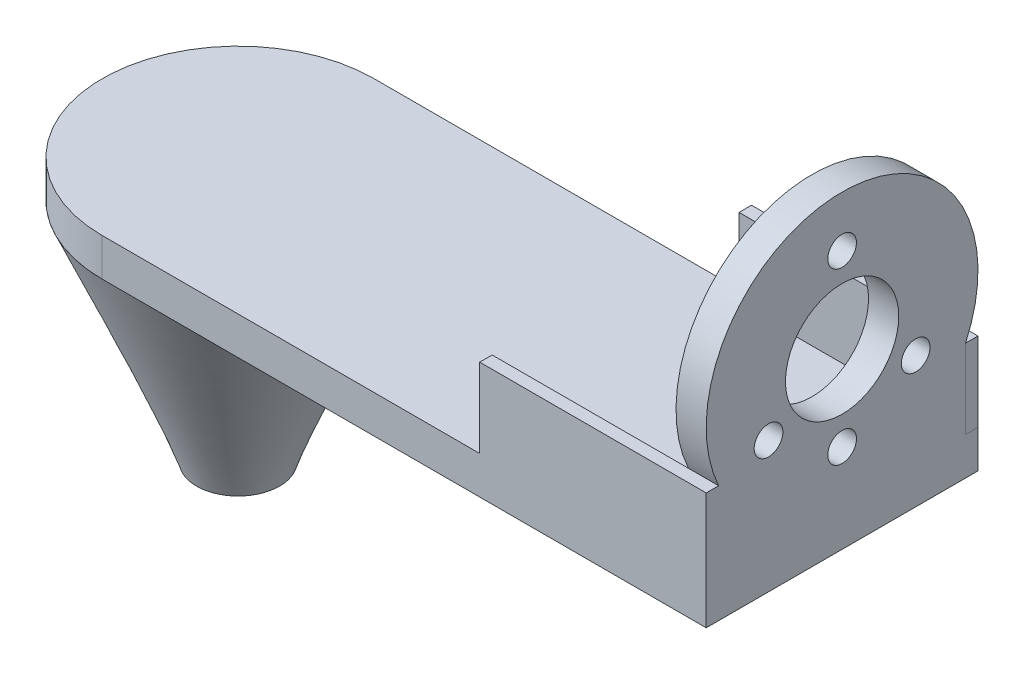
ISO-10303-21;
HEADER;
FILE_DESCRIPTION(('STEP AP214'),'2;1');
FILE_NAME('part.step','',(''),(''),'','','');
FILE_SCHEMA(('AUTOMOTIVE_DESIGN { 1 0 10303 214 1 1 1 1 }'));
ENDSEC;
DATA;
#1=APPLICATION_CONTEXT('core data for automotive mechanical design processes');
#2=APPLICATION_PROTOCOL_DEFINITION('international standard','automotive_design',2000,#1);
#3=PRODUCT_CONTEXT('',#1,'mechanical');
#4=PRODUCT('Part','Part','',(#3));
#5=PRODUCT_RELATED_PRODUCT_CATEGORY('part','',(#4));
#6=PRODUCT_DEFINITION_FORMATION('','',#4);
#7=PRODUCT_DEFINITION_CONTEXT('part definition',#1,'design');
#8=PRODUCT_DEFINITION('design','',#6,#7);
#9=PRODUCT_DEFINITION_SHAPE('','',#8);
#10=(LENGTH_UNIT() NAMED_UNIT(*) SI_UNIT(.MILLI.,.METRE.));
#11=(NAMED_UNIT(*) PLANE_ANGLE_UNIT() SI_UNIT($,.RADIAN.));
#12=(NAMED_UNIT(*) SI_UNIT($,.STERADIAN.) SOLID_ANGLE_UNIT());
#13=UNCERTAINTY_MEASURE_WITH_UNIT(LENGTH_MEASURE(1.E-05),#10,'distance_accuracy_value','');
#14=(GEOMETRIC_REPRESENTATION_CONTEXT(3) GLOBAL_UNCERTAINTY_ASSIGNED_CONTEXT((#13)) GLOBAL_UNIT_ASSIGNED_CONTEXT((#10,
#11,#12)) REPRESENTATION_CONTEXT('',''));
#15=CARTESIAN_POINT('',(0.,0.,0.));
#16=DIRECTION('',(0.,0.,1.));
#17=DIRECTION('',(1.,0.,0.));
#18=AXIS2_PLACEMENT_3D('',#15,#16,#17);
#19=CARTESIAN_POINT('',(35.7169744385048,48.2713976551319,84.2435072904092));
#20=DIRECTION('',(0.,-1.,0.));
#21=DIRECTION('',(0.,0.,-1.));
#22=AXIS2_PLACEMENT_3D('',#19,#20,#21);
#23=PLANE('',#22);
#24=DIRECTION('',(0.,0.,-1.));
#25=VECTOR('',#24,1.);
#26=CARTESIAN_POINT('',(65.7169744385048,48.2713976551319,84.2435072904092));
#27=LINE('',#26,#25);
#28=CARTESIAN_POINT('',(65.7169744385048,48.2713976551319,67.8905021606148));
#29=VERTEX_POINT('',#28);
#30=CARTESIAN_POINT('',(65.7169744385048,48.2713976551319,66.2435072904092));
#31=VERTEX_POINT('',#30);
#32=EDGE_CURVE('P0_E79',#29,#31,#27,.T.);
#33=ORIENTED_EDGE('',*,*,#32,.T.);
#34=DIRECTION('',(1.,0.,0.));
#35=VECTOR('',#34,1.);
#36=CARTESIAN_POINT('',(35.7169744385048,48.2713976551319,66.2435072904092));
#37=LINE('',#36,#35);
#38=CARTESIAN_POINT('',(35.7169744385048,48.2713976551319,66.2435072904092));
#39=VERTEX_POINT('',#38);
#40=EDGE_CURVE('P0_E11',#39,#31,#37,.T.);
#41=ORIENTED_EDGE('',*,*,#40,.F.);
#42=DIRECTION('',(0.,0.,-1.));
#43=VECTOR('',#42,1.);
#44=CARTESIAN_POINT('',(35.7169744385048,48.2713976551319,84.2435072904092));
#45=LINE('',#44,#43);
#46=CARTESIAN_POINT('',(35.7169744385048,48.2713976551319,67.8905021606148));
#47=VERTEX_POINT('',#46);
#48=EDGE_CURVE('P0_E34',#47,#39,#45,.T.);
#49=ORIENTED_EDGE('',*,*,#48,.F.);
#50=DIRECTION('',(1.,0.,0.));
#51=VECTOR('',#50,1.);
#52=CARTESIAN_POINT('',(35.7169744385048,48.2713976551319,67.8905021606148));
#53=LINE('',#52,#51);
#54=EDGE_CURVE('P0_E19',#47,#29,#53,.T.);
#55=ORIENTED_EDGE('',*,*,#54,.T.);
#56=EDGE_LOOP('',(#33,#41,#49,#55));
#57=FACE_BOUND('',#56,.T.);
#58=ADVANCED_FACE('P0_F16',(#57),#23,.F.);
#59=CARTESIAN_POINT('',(35.7169744385048,38.2933138488233,66.2435072904092));
#60=DIRECTION('',(0.,0.,-1.));
#61=DIRECTION('',(-1.,0.,0.));
#62=AXIS2_PLACEMENT_3D('',#59,#60,#61);
#63=PLANE('',#62);
#64=DIRECTION('',(0.,1.,0.));
#65=VECTOR('',#64,1.);
#66=CARTESIAN_POINT('',(65.7169744385048,38.2933138488233,66.2435072904092));
#67=LINE('',#66,#65);
#68=CARTESIAN_POINT('',(65.7169744385048,37.7933138488233,66.2435072904092));
#69=VERTEX_POINT('',#68);
#70=EDGE_CURVE('P0_E75',#69,#31,#67,.T.);
#71=ORIENTED_EDGE('',*,*,#70,.F.);
#72=DIRECTION('',(1.,0.,0.));
#73=VECTOR('',#72,1.);
#74=CARTESIAN_POINT('',(35.7169744385048,37.7933138488233,66.2435072904092));
#75=LINE('',#74,#73);
#76=CARTESIAN_POINT('',(35.7169744385048,37.7933138488233,66.2435072904092));
#77=VERTEX_POINT('',#76);
#78=EDGE_CURVE('P0_E25',#77,#69,#75,.T.);
#79=ORIENTED_EDGE('',*,*,#78,.F.);
#80=DIRECTION('',(0.,1.,0.));
#81=VECTOR('',#80,1.);
#82=CARTESIAN_POINT('',(35.7169744385048,38.2933138488233,66.2435072904092));
#83=LINE('',#82,#81);
#84=EDGE_CURVE('P0_E71',#77,#39,#83,.T.);
#85=ORIENTED_EDGE('',*,*,#84,.T.);
#86=ORIENTED_EDGE('',*,*,#40,.T.);
#87=EDGE_LOOP('',(#71,#79,#85,#86));
#88=FACE_BOUND('',#87,.T.);
#89=ADVANCED_FACE('P0_F89',(#88),#63,.T.);
#90=CARTESIAN_POINT('',(35.7169744385048,37.7933138488233,84.2435072904092));
#91=DIRECTION('',(0.,-1.,0.));
#92=DIRECTION('',(0.,0.,-1.));
#93=AXIS2_PLACEMENT_3D('',#90,#91,#92);
#94=PLANE('',#93);
#95=DIRECTION('',(0.,0.,-1.));
#96=VECTOR('',#95,1.);
#97=CARTESIAN_POINT('',(65.7169744385048,37.7933138488233,84.2435072904092));
#98=LINE('',#97,#96);
#99=CARTESIAN_POINT('',(65.7169744385048,37.7933138488233,67.8905021606148));
#100=VERTEX_POINT('',#99);
#101=EDGE_CURVE('P0_E67',#100,#69,#98,.T.);
#102=ORIENTED_EDGE('',*,*,#101,.F.);
#103=DIRECTION('',(1.,0.,0.));
#104=VECTOR('',#103,1.);
#105=CARTESIAN_POINT('',(35.7169744385048,37.7933138488233,67.8905021606148));
#106=LINE('',#105,#104);
#107=CARTESIAN_POINT('',(35.7169744385048,37.7933138488233,67.8905021606148));
#108=VERTEX_POINT('',#107);
#109=EDGE_CURVE('P0_E63',#108,#100,#106,.T.);
#110=ORIENTED_EDGE('',*,*,#109,.F.);
#111=DIRECTION('',(0.,0.,-1.));
#112=VECTOR('',#111,1.);
#113=CARTESIAN_POINT('',(35.7169744385048,37.7933138488233,84.2435072904092));
#114=LINE('',#113,#112);
#115=EDGE_CURVE('P0_E66',#108,#77,#114,.T.);
#116=ORIENTED_EDGE('',*,*,#115,.T.);
#117=ORIENTED_EDGE('',*,*,#78,.T.);
#118=EDGE_LOOP('',(#102,#110,#116,#117));
#119=FACE_BOUND('',#118,.T.);
#120=ADVANCED_FACE('P0_F65',(#119),#94,.T.);
#121=CARTESIAN_POINT('',(35.7169744385048,38.2933138488233,67.8905021606148));
#122=DIRECTION('',(0.,0.,1.));
#123=DIRECTION('',(1.,0.,0.));
#124=AXIS2_PLACEMENT_3D('',#121,#122,#123);
#125=PLANE('',#124);
#126=DIRECTION('',(0.,-1.,0.));
#127=VECTOR('',#126,1.);
#128=CARTESIAN_POINT('',(65.7169744385048,38.2933138488233,67.8905021606148));
#129=LINE('',#128,#127);
#130=EDGE_CURVE('P0_E81',#29,#100,#129,.T.);
#131=ORIENTED_EDGE('',*,*,#130,.F.);
#132=ORIENTED_EDGE('',*,*,#54,.F.);
#133=DIRECTION('',(0.,-1.,0.));
#134=VECTOR('',#133,1.);
#135=CARTESIAN_POINT('',(35.7169744385048,38.2933138488233,67.8905021606148));
#136=LINE('',#135,#134);
#137=EDGE_CURVE('P0_E70',#47,#108,#136,.T.);
#138=ORIENTED_EDGE('',*,*,#137,.T.);
#139=ORIENTED_EDGE('',*,*,#109,.T.);
#140=EDGE_LOOP('',(#131,#132,#138,#139));
#141=FACE_BOUND('',#140,.T.);
#142=ADVANCED_FACE('P0_F73',(#141),#125,.T.);
#143=CARTESIAN_POINT('',(35.7169744385048,38.2933138488233,84.2435072904092));
#144=DIRECTION('',(1.,0.,0.));
#145=DIRECTION('',(0.,0.,-1.));
#146=AXIS2_PLACEMENT_3D('',#143,#144,#145);
#147=PLANE('',#146);
#148=ORIENTED_EDGE('',*,*,#48,.T.);
#149=ORIENTED_EDGE('',*,*,#84,.F.);
#150=ORIENTED_EDGE('',*,*,#115,.F.);
#151=ORIENTED_EDGE('',*,*,#137,.F.);
#152=EDGE_LOOP('',(#148,#149,#150,#151));
#153=FACE_BOUND('',#152,.T.);
#154=ADVANCED_FACE('P0_F69',(#153),#147,.F.);
#155=CARTESIAN_POINT('',(65.7169744385048,38.2933138488233,84.2435072904092));
#156=DIRECTION('',(1.,0.,0.));
#157=DIRECTION('',(0.,0.,-1.));
#158=AXIS2_PLACEMENT_3D('',#155,#156,#157);
#159=PLANE('',#158);
#160=ORIENTED_EDGE('',*,*,#32,.F.);
#161=ORIENTED_EDGE('',*,*,#130,.T.);
#162=ORIENTED_EDGE('',*,*,#101,.T.);
#163=ORIENTED_EDGE('',*,*,#70,.T.);
#164=EDGE_LOOP('',(#160,#161,#162,#163));
#165=FACE_BOUND('',#164,.T.);
#166=ADVANCED_FACE('P0_F88',(#165),#159,.T.);
#167=CLOSED_SHELL('',(#58,#89,#120,#142,#154,#166));
#168=MANIFOLD_SOLID_BREP('P0_B1',#167);
#169=CARTESIAN_POINT('',(-14.2830255614952,32.7933138488233,84.2435072904092));
#170=DIRECTION('',(0.,1.,0.));
#171=DIRECTION('',(0.,0.,1.));
#172=AXIS2_PLACEMENT_3D('',#169,#170,#171);
#173=CYLINDRICAL_SURFACE('',#172,18.);
#174=DIRECTION('',(0.,1.,0.));
#175=VECTOR('',#174,1.);
#176=CARTESIAN_POINT('',(-14.2830255614952,38.2933138488233,102.243507290409));
#177=LINE('',#176,#175);
#178=CARTESIAN_POINT('',(-14.2830255614952,32.7933138488233,102.243507290409));
#179=VERTEX_POINT('',#178);
#180=CARTESIAN_POINT('',(-14.2830255614952,37.7933138488233,102.243507290409));
#181=VERTEX_POINT('',#180);
#182=EDGE_CURVE('P1_E107',#179,#181,#177,.T.);
#183=ORIENTED_EDGE('',*,*,#182,.T.);
#184=CARTESIAN_POINT('',(-14.2830255614952,37.7933138488233,84.2435072904092));
#185=DIRECTION('',(0.,1.,0.));
#186=DIRECTION('',(0.,0.,1.));
#187=AXIS2_PLACEMENT_3D('',#184,#185,#186);
#188=CIRCLE('',#187,18.);
#189=CARTESIAN_POINT('',(-14.2830255614952,37.7933138488233,66.2435072904092));
#190=VERTEX_POINT('',#189);
#191=EDGE_CURVE('P1_E90',#190,#181,#188,.T.);
#192=ORIENTED_EDGE('',*,*,#191,.F.);
#193=DIRECTION('',(0.,-1.,0.));
#194=VECTOR('',#193,1.);
#195=CARTESIAN_POINT('',(-14.2830255614952,38.2933138488233,66.2435072904092));
#196=LINE('',#195,#194);
#197=CARTESIAN_POINT('',(-14.2830255614952,32.7933138488233,66.2435072904092));
#198=VERTEX_POINT('',#197);
#199=EDGE_CURVE('P1_E112',#190,#198,#196,.T.);
#200=ORIENTED_EDGE('',*,*,#199,.T.);
#201=CARTESIAN_POINT('',(-14.2830255614952,32.7933138488233,84.2435072904092));
#202=DIRECTION('',(0.,1.,0.));
#203=DIRECTION('',(0.,0.,1.));
#204=AXIS2_PLACEMENT_3D('',#201,#202,#203);
#205=CIRCLE('',#204,18.);
#206=EDGE_CURVE('P1_E101',#198,#179,#205,.T.);
#207=ORIENTED_EDGE('',*,*,#206,.T.);
#208=EDGE_LOOP('',(#183,#192,#200,#207));
#209=FACE_BOUND('',#208,.T.);
#210=ADVANCED_FACE('P1_F16',(#209),#173,.T.);
#211=CARTESIAN_POINT('',(-14.2830255614952,37.7933138488233,84.2435072904092));
#212=DIRECTION('',(0.,-1.,0.));
#213=DIRECTION('',(0.,0.,-1.));
#214=AXIS2_PLACEMENT_3D('',#211,#212,#213);
#215=PLANE('',#214);
#216=DIRECTION('',(1.,0.,0.));
#217=VECTOR('',#216,1.);
#218=CARTESIAN_POINT('',(61.7169744385048,37.7933138488233,67.8905021606148));
#219=LINE('',#218,#217);
#220=CARTESIAN_POINT('',(61.7169744385048,37.7933138488233,67.8905021606148));
#221=VERTEX_POINT('',#220);
#222=CARTESIAN_POINT('',(65.7169744385048,37.7933138488233,67.8905021606148));
#223=VERTEX_POINT('',#222);
#224=EDGE_CURVE('P1_E196',#221,#223,#219,.T.);
#225=ORIENTED_EDGE('',*,*,#224,.T.);
#226=DIRECTION('',(0.,0.,-1.));
#227=VECTOR('',#226,1.);
#228=CARTESIAN_POINT('',(65.7169744385048,37.7933138488233,84.2435072904092));
#229=LINE('',#228,#227);
#230=CARTESIAN_POINT('',(65.7169744385048,37.7933138488233,66.2435072904092));
#231=VERTEX_POINT('',#230);
#232=EDGE_CURVE('P1_E125',#223,#231,#229,.T.);
#233=ORIENTED_EDGE('',*,*,#232,.T.);
#234=DIRECTION('',(1.,0.,0.));
#235=VECTOR('',#234,1.);
#236=CARTESIAN_POINT('',(-14.2830255614952,37.7933138488233,66.2435072904092));
#237=LINE('',#236,#235);
#238=EDGE_CURVE('P1_E96',#190,#231,#237,.T.);
#239=ORIENTED_EDGE('',*,*,#238,.F.);
#240=ORIENTED_EDGE('',*,*,#191,.T.);
#241=DIRECTION('',(1.,0.,0.));
#242=VECTOR('',#241,1.);
#243=CARTESIAN_POINT('',(-14.2830255614952,37.7933138488233,102.243507290409));
#244=LINE('',#243,#242);
#245=CARTESIAN_POINT('',(35.7169744385048,37.7933138488233,102.243507290409));
#246=VERTEX_POINT('',#245);
#247=EDGE_CURVE('P1_E93',#181,#246,#244,.T.);
#248=ORIENTED_EDGE('',*,*,#247,.T.);
#249=DIRECTION('',(0.,0.,1.));
#250=VECTOR('',#249,1.);
#251=CARTESIAN_POINT('',(35.7169744385048,37.7933138488233,84.2435072904092));
#252=LINE('',#251,#250);
#253=CARTESIAN_POINT('',(35.7169744385048,37.7933138488233,100.596512420204));
#254=VERTEX_POINT('',#253);
#255=EDGE_CURVE('P1_E200',#254,#246,#252,.T.);
#256=ORIENTED_EDGE('',*,*,#255,.F.);
#257=DIRECTION('',(1.,0.,0.));
#258=VECTOR('',#257,1.);
#259=CARTESIAN_POINT('',(35.7169744385048,37.7933138488233,100.596512420204));
#260=LINE('',#259,#258);
#261=CARTESIAN_POINT('',(61.7169744385048,37.7933138488233,100.596512420204));
#262=VERTEX_POINT('',#261);
#263=EDGE_CURVE('P1_E128',#254,#262,#260,.T.);
#264=ORIENTED_EDGE('',*,*,#263,.T.);
#265=DIRECTION('',(0.,0.,1.));
#266=VECTOR('',#265,1.);
#267=CARTESIAN_POINT('',(61.7169744385048,37.7933138488233,84.2435072904092));
#268=LINE('',#267,#266);
#269=EDGE_CURVE('P1_E33',#221,#262,#268,.T.);
#270=ORIENTED_EDGE('',*,*,#269,.F.);
#271=EDGE_LOOP('',(#225,#233,#239,#240,#248,#256,#264,#270));
#272=FACE_BOUND('',#271,.T.);
#273=ADVANCED_FACE('P1_F92',(#272),#215,.F.);
#274=CARTESIAN_POINT('',(61.7169744385048,55.7933138488233,84.2435072904092));
#275=DIRECTION('',(1.,0.,0.));
#276=DIRECTION('',(0.,0.,-1.));
#277=AXIS2_PLACEMENT_3D('',#274,#275,#276);
#278=CYLINDRICAL_SURFACE('',#277,18.);
#279=CARTESIAN_POINT('',(65.7169744385048,55.7933138488233,84.2435072904092));
#280=DIRECTION('',(1.,0.,0.));
#281=DIRECTION('',(0.,0.,-1.));
#282=AXIS2_PLACEMENT_3D('',#279,#280,#281);
#283=CIRCLE('',#282,18.);
#284=CARTESIAN_POINT('',(65.7169744385048,48.2713976551319,67.8905021606148));
#285=VERTEX_POINT('',#284);
#286=CARTESIAN_POINT('',(65.7169744385048,48.2713976551319,100.596512420204));
#287=VERTEX_POINT('',#286);
#288=EDGE_CURVE('P1_E20',#285,#287,#283,.T.);
#289=ORIENTED_EDGE('',*,*,#288,.F.);
#290=DIRECTION('',(1.,0.,0.));
#291=VECTOR('',#290,1.);
#292=CARTESIAN_POINT('',(61.7169744385048,48.2713976551319,67.8905021606148));
#293=LINE('',#292,#291);
#294=CARTESIAN_POINT('',(61.7169744385048,48.2713976551319,67.8905021606148));
#295=VERTEX_POINT('',#294);
#296=EDGE_CURVE('P1_E40',#295,#285,#293,.T.);
#297=ORIENTED_EDGE('',*,*,#296,.F.);
#298=CARTESIAN_POINT('',(61.7169744385048,55.7933138488233,84.2435072904092));
#299=DIRECTION('',(1.,0.,0.));
#300=DIRECTION('',(0.,0.,-1.));
#301=AXIS2_PLACEMENT_3D('',#298,#299,#300);
#302=CIRCLE('',#301,18.);
#303=CARTESIAN_POINT('',(61.7169744385048,48.2713976551319,100.596512420204));
#304=VERTEX_POINT('',#303);
#305=EDGE_CURVE('P1_E11',#295,#304,#302,.T.);
#306=ORIENTED_EDGE('',*,*,#305,.T.);
#307=DIRECTION('',(1.,0.,0.));
#308=VECTOR('',#307,1.);
#309=CARTESIAN_POINT('',(61.7169744385048,48.2713976551319,100.596512420204));
#310=LINE('',#309,#308);
#311=EDGE_CURVE('P1_E140',#304,#287,#310,.T.);
#312=ORIENTED_EDGE('',*,*,#311,.T.);
#313=EDGE_LOOP('',(#289,#297,#306,#312));
#314=FACE_BOUND('',#313,.T.);
#315=ADVANCED_FACE('P1_F183',(#314),#278,.T.);
#316=CARTESIAN_POINT('',(61.7169744385048,55.7933138488233,84.2435072904092));
#317=DIRECTION('',(1.,0.,0.));
#318=DIRECTION('',(0.,0.,-1.));
#319=AXIS2_PLACEMENT_3D('',#316,#317,#318);
#320=CYLINDRICAL_SURFACE('',#319,7.5);
#321=CARTESIAN_POINT('',(61.7169744385048,55.7933138488233,84.2435072904092));
#322=DIRECTION('',(1.,0.,0.));
#323=DIRECTION('',(0.,0.,-1.));
#324=AXIS2_PLACEMENT_3D('',#321,#322,#323);
#325=CIRCLE('',#324,7.5);
#326=CARTESIAN_POINT('',(61.7169744385048,55.7933138488233,76.7435072904092));
#327=VERTEX_POINT('',#326);
#328=EDGE_CURVE('P1_E25',#327,#327,#325,.T.);
#329=ORIENTED_EDGE('',*,*,#328,.F.);
#330=EDGE_LOOP('',(#329));
#331=FACE_BOUND('',#330,.T.);
#332=CARTESIAN_POINT('',(65.7169744385048,55.7933138488233,84.2435072904092));
#333=DIRECTION('',(1.,0.,0.));
#334=DIRECTION('',(0.,0.,-1.));
#335=AXIS2_PLACEMENT_3D('',#332,#333,#334);
#336=CIRCLE('',#335,7.5);
#337=CARTESIAN_POINT('',(65.7169744385048,55.7933138488233,76.7435072904092));
#338=VERTEX_POINT('',#337);
#339=EDGE_CURVE('P1_E168',#338,#338,#336,.T.);
#340=ORIENTED_EDGE('',*,*,#339,.T.);
#341=EDGE_LOOP('',(#340));
#342=FACE_BOUND('',#341,.T.);
#343=ADVANCED_FACE('P1_F340',(#331,#342),#320,.F.);
#344=CARTESIAN_POINT('',(61.7169744385048,50.1713976551319,93.988072868777));
#345=DIRECTION('',(1.,0.,0.));
#346=DIRECTION('',(0.,0.,-1.));
#347=AXIS2_PLACEMENT_3D('',#344,#345,#346);
#348=CYLINDRICAL_SURFACE('',#347,1.9);
#349=CARTESIAN_POINT('',(61.7169744385048,50.1713976551319,93.988072868777));
#350=DIRECTION('',(1.,0.,0.));
#351=DIRECTION('',(0.,0.,-1.));
#352=AXIS2_PLACEMENT_3D('',#349,#350,#351);
#353=CIRCLE('',#352,1.9);
#354=CARTESIAN_POINT('',(61.7169744385048,50.1713976551319,92.088072868777));
#355=VERTEX_POINT('',#354);
#356=EDGE_CURVE('P1_E153',#355,#355,#353,.T.);
#357=ORIENTED_EDGE('',*,*,#356,.F.);
#358=EDGE_LOOP('',(#357));
#359=FACE_BOUND('',#358,.T.);
#360=CARTESIAN_POINT('',(65.7169744385048,50.1713976551319,93.988072868777));
#361=DIRECTION('',(1.,0.,0.));
#362=DIRECTION('',(0.,0.,-1.));
#363=AXIS2_PLACEMENT_3D('',#360,#361,#362);
#364=CIRCLE('',#363,1.9);
#365=CARTESIAN_POINT('',(65.7169744385048,50.1713976551319,92.088072868777));
#366=VERTEX_POINT('',#365);
#367=EDGE_CURVE('P1_E166',#366,#366,#364,.T.);
#368=ORIENTED_EDGE('',*,*,#367,.T.);
#369=EDGE_LOOP('',(#368));
#370=FACE_BOUND('',#369,.T.);
#371=ADVANCED_FACE('P1_F331',(#359,#370),#348,.F.);
#372=CARTESIAN_POINT('',(61.7169744385048,44.5433138488233,84.2435072904092));
#373=DIRECTION('',(1.,0.,0.));
#374=DIRECTION('',(0.,0.,-1.));
#375=AXIS2_PLACEMENT_3D('',#372,#373,#374);
#376=CYLINDRICAL_SURFACE('',#375,1.9);
#377=CARTESIAN_POINT('',(61.7169744385048,44.5433138488233,84.2435072904092));
#378=DIRECTION('',(1.,0.,0.));
#379=DIRECTION('',(0.,0.,-1.));
#380=AXIS2_PLACEMENT_3D('',#377,#378,#379);
#381=CIRCLE('',#380,1.9);
#382=CARTESIAN_POINT('',(61.7169744385048,44.5433138488233,82.3435072904092));
#383=VERTEX_POINT('',#382);
#384=EDGE_CURVE('P1_E150',#383,#383,#381,.T.);
#385=ORIENTED_EDGE('',*,*,#384,.F.);
#386=EDGE_LOOP('',(#385));
#387=FACE_BOUND('',#386,.T.);
#388=CARTESIAN_POINT('',(65.7169744385048,44.5433138488233,84.2435072904092));
#389=DIRECTION('',(1.,0.,0.));
#390=DIRECTION('',(0.,0.,-1.));
#391=AXIS2_PLACEMENT_3D('',#388,#389,#390);
#392=CIRCLE('',#391,1.9);
#393=CARTESIAN_POINT('',(65.7169744385048,44.5433138488233,82.3435072904092));
#394=VERTEX_POINT('',#393);
#395=EDGE_CURVE('P1_E163',#394,#394,#392,.T.);
#396=ORIENTED_EDGE('',*,*,#395,.T.);
#397=EDGE_LOOP('',(#396));
#398=FACE_BOUND('',#397,.T.);
#399=ADVANCED_FACE('P1_F323',(#387,#398),#376,.F.);
#400=CARTESIAN_POINT('',(61.7169744385048,50.1713976551319,74.4989417120414));
#401=DIRECTION('',(1.,0.,0.));
#402=DIRECTION('',(0.,0.,-1.));
#403=AXIS2_PLACEMENT_3D('',#400,#401,#402);
#404=CYLINDRICAL_SURFACE('',#403,1.9);
#405=CARTESIAN_POINT('',(61.7169744385048,50.1713976551319,74.4989417120414));
#406=DIRECTION('',(1.,0.,0.));
#407=DIRECTION('',(0.,0.,-1.));
#408=AXIS2_PLACEMENT_3D('',#405,#406,#407);
#409=CIRCLE('',#408,1.9);
#410=CARTESIAN_POINT('',(61.7169744385048,50.1713976551319,72.5989417120414));
#411=VERTEX_POINT('',#410);
#412=EDGE_CURVE('P1_E147',#411,#411,#409,.T.);
#413=ORIENTED_EDGE('',*,*,#412,.F.);
#414=EDGE_LOOP('',(#413));
#415=FACE_BOUND('',#414,.T.);
#416=CARTESIAN_POINT('',(65.7169744385048,50.1713976551319,74.4989417120414));
#417=DIRECTION('',(1.,0.,0.));
#418=DIRECTION('',(0.,0.,-1.));
#419=AXIS2_PLACEMENT_3D('',#416,#417,#418);
#420=CIRCLE('',#419,1.9);
#421=CARTESIAN_POINT('',(65.7169744385048,50.1713976551319,72.5989417120414));
#422=VERTEX_POINT('',#421);
#423=EDGE_CURVE('P1_E160',#422,#422,#420,.T.);
#424=ORIENTED_EDGE('',*,*,#423,.T.);
#425=EDGE_LOOP('',(#424));
#426=FACE_BOUND('',#425,.T.);
#427=ADVANCED_FACE('P1_F315',(#415,#426),#404,.F.);
#428=CARTESIAN_POINT('',(61.7169744385048,67.0433138488233,84.2435072904092));
#429=DIRECTION('',(1.,0.,0.));
#430=DIRECTION('',(0.,0.,-1.));
#431=AXIS2_PLACEMENT_3D('',#428,#429,#430);
#432=CYLINDRICAL_SURFACE('',#431,1.9);
#433=CARTESIAN_POINT('',(61.7169744385048,67.0433138488233,84.2435072904092));
#434=DIRECTION('',(1.,0.,0.));
#435=DIRECTION('',(0.,0.,-1.));
#436=AXIS2_PLACEMENT_3D('',#433,#434,#435);
#437=CIRCLE('',#436,1.9);
#438=CARTESIAN_POINT('',(61.7169744385048,67.0433138488233,82.3435072904092));
#439=VERTEX_POINT('',#438);
#440=EDGE_CURVE('P1_E144',#439,#439,#437,.T.);
#441=ORIENTED_EDGE('',*,*,#440,.F.);
#442=EDGE_LOOP('',(#441));
#443=FACE_BOUND('',#442,.T.);
#444=CARTESIAN_POINT('',(65.7169744385048,67.0433138488233,84.2435072904092));
#445=DIRECTION('',(1.,0.,0.));
#446=DIRECTION('',(0.,0.,-1.));
#447=AXIS2_PLACEMENT_3D('',#444,#445,#446);
#448=CIRCLE('',#447,1.9);
#449=CARTESIAN_POINT('',(65.7169744385048,67.0433138488233,82.3435072904092));
#450=VERTEX_POINT('',#449);
#451=EDGE_CURVE('P1_E143',#450,#450,#448,.T.);
#452=ORIENTED_EDGE('',*,*,#451,.T.);
#453=EDGE_LOOP('',(#452));
#454=FACE_BOUND('',#453,.T.);
#455=ADVANCED_FACE('P1_F18',(#443,#454),#432,.F.);
#456=CARTESIAN_POINT('',(61.7169744385048,38.2933138488233,84.2435072904092));
#457=DIRECTION('',(1.,0.,0.));
#458=DIRECTION('',(0.,0.,-1.));
#459=AXIS2_PLACEMENT_3D('',#456,#457,#458);
#460=PLANE('',#459);
#461=ORIENTED_EDGE('',*,*,#440,.T.);
#462=EDGE_LOOP('',(#461));
#463=FACE_BOUND('',#462,.T.);
#464=ORIENTED_EDGE('',*,*,#412,.T.);
#465=EDGE_LOOP('',(#464));
#466=FACE_BOUND('',#465,.T.);
#467=ORIENTED_EDGE('',*,*,#384,.T.);
#468=EDGE_LOOP('',(#467));
#469=FACE_BOUND('',#468,.T.);
#470=ORIENTED_EDGE('',*,*,#356,.T.);
#471=EDGE_LOOP('',(#470));
#472=FACE_BOUND('',#471,.T.);
#473=ORIENTED_EDGE('',*,*,#328,.T.);
#474=EDGE_LOOP('',(#473));
#475=FACE_BOUND('',#474,.T.);
#476=ORIENTED_EDGE('',*,*,#305,.F.);
#477=DIRECTION('',(0.,-1.,0.));
#478=VECTOR('',#477,1.);
#479=CARTESIAN_POINT('',(61.7169744385048,38.2933138488233,67.8905021606148));
#480=LINE('',#479,#478);
#481=EDGE_CURVE('P1_E208',#295,#221,#480,.T.);
#482=ORIENTED_EDGE('',*,*,#481,.T.);
#483=ORIENTED_EDGE('',*,*,#269,.T.);
#484=DIRECTION('',(0.,-1.,0.));
#485=VECTOR('',#484,1.);
#486=CARTESIAN_POINT('',(61.7169744385048,38.2933138488233,100.596512420204));
#487=LINE('',#486,#485);
#488=EDGE_CURVE('P1_E132',#304,#262,#487,.T.);
#489=ORIENTED_EDGE('',*,*,#488,.F.);
#490=EDGE_LOOP('',(#476,#482,#483,#489));
#491=FACE_BOUND('',#490,.T.);
#492=ADVANCED_FACE('P1_F215',(#463,#466,#469,#472,#475,#491),#460,.F.);
#493=CARTESIAN_POINT('',(65.7169744385048,38.2933138488233,84.2435072904092));
#494=DIRECTION('',(1.,0.,0.));
#495=DIRECTION('',(0.,0.,-1.));
#496=AXIS2_PLACEMENT_3D('',#493,#494,#495);
#497=PLANE('',#496);
#498=DIRECTION('',(0.,-1.,0.));
#499=VECTOR('',#498,1.);
#500=CARTESIAN_POINT('',(65.7169744385048,38.2933138488233,67.8905021606148));
#501=LINE('',#500,#499);
#502=EDGE_CURVE('P1_E181',#285,#223,#501,.T.);
#503=ORIENTED_EDGE('',*,*,#502,.F.);
#504=ORIENTED_EDGE('',*,*,#288,.T.);
#505=DIRECTION('',(0.,0.,1.));
#506=VECTOR('',#505,1.);
#507=CARTESIAN_POINT('',(65.7169744385048,48.2713976551319,84.2435072904092));
#508=LINE('',#507,#506);
#509=CARTESIAN_POINT('',(65.7169744385048,48.2713976551319,102.243507290409));
#510=VERTEX_POINT('',#509);
#511=EDGE_CURVE('P1_E179',#287,#510,#508,.T.);
#512=ORIENTED_EDGE('',*,*,#511,.T.);
#513=DIRECTION('',(0.,1.,0.));
#514=VECTOR('',#513,1.);
#515=CARTESIAN_POINT('',(65.7169744385048,38.2933138488233,102.243507290409));
#516=LINE('',#515,#514);
#517=CARTESIAN_POINT('',(65.7169744385048,32.7933138488233,102.243507290409));
#518=VERTEX_POINT('',#517);
#519=EDGE_CURVE('P1_E127',#518,#510,#516,.T.);
#520=ORIENTED_EDGE('',*,*,#519,.F.);
#521=DIRECTION('',(0.,0.,1.));
#522=VECTOR('',#521,1.);
#523=CARTESIAN_POINT('',(65.7169744385048,32.7933138488233,84.2435072904092));
#524=LINE('',#523,#522);
#525=CARTESIAN_POINT('',(65.7169744385048,32.7933138488233,66.2435072904092));
#526=VERTEX_POINT('',#525);
#527=EDGE_CURVE('P1_E119',#526,#518,#524,.T.);
#528=ORIENTED_EDGE('',*,*,#527,.F.);
#529=DIRECTION('',(0.,-1.,0.));
#530=VECTOR('',#529,1.);
#531=CARTESIAN_POINT('',(65.7169744385048,38.2933138488233,66.2435072904092));
#532=LINE('',#531,#530);
#533=EDGE_CURVE('P1_E116',#231,#526,#532,.T.);
#534=ORIENTED_EDGE('',*,*,#533,.F.);
#535=ORIENTED_EDGE('',*,*,#232,.F.);
#536=EDGE_LOOP('',(#503,#504,#512,#520,#528,#534,#535));
#537=FACE_BOUND('',#536,.T.);
#538=ORIENTED_EDGE('',*,*,#451,.F.);
#539=EDGE_LOOP('',(#538));
#540=FACE_BOUND('',#539,.T.);
#541=ORIENTED_EDGE('',*,*,#423,.F.);
#542=EDGE_LOOP('',(#541));
#543=FACE_BOUND('',#542,.T.);
#544=ORIENTED_EDGE('',*,*,#395,.F.);
#545=EDGE_LOOP('',(#544));
#546=FACE_BOUND('',#545,.T.);
#547=ORIENTED_EDGE('',*,*,#367,.F.);
#548=EDGE_LOOP('',(#547));
#549=FACE_BOUND('',#548,.T.);
#550=ORIENTED_EDGE('',*,*,#339,.F.);
#551=EDGE_LOOP('',(#550));
#552=FACE_BOUND('',#551,.T.);
#553=ADVANCED_FACE('P1_F175',(#537,#540,#543,#546,#549,#552),#497,.T.);
#554=CARTESIAN_POINT('',(-14.2830255614952,38.2933138488233,66.2435072904092));
#555=DIRECTION('',(0.,0.,1.));
#556=DIRECTION('',(1.,0.,0.));
#557=AXIS2_PLACEMENT_3D('',#554,#555,#556);
#558=PLANE('',#557);
#559=ORIENTED_EDGE('',*,*,#533,.T.);
#560=DIRECTION('',(1.,0.,0.));
#561=VECTOR('',#560,1.);
#562=CARTESIAN_POINT('',(-14.2830255614952,32.7933138488233,66.2435072904092));
#563=LINE('',#562,#561);
#564=EDGE_CURVE('P1_E133',#198,#526,#563,.T.);
#565=ORIENTED_EDGE('',*,*,#564,.F.);
#566=ORIENTED_EDGE('',*,*,#199,.F.);
#567=ORIENTED_EDGE('',*,*,#238,.T.);
#568=EDGE_LOOP('',(#559,#565,#566,#567));
#569=FACE_BOUND('',#568,.T.);
#570=ADVANCED_FACE('P1_F221',(#569),#558,.F.);
#571=CARTESIAN_POINT('',(-14.2830255614952,32.7933138488233,84.2435072904092));
#572=DIRECTION('',(0.,1.,0.));
#573=DIRECTION('',(0.,0.,1.));
#574=AXIS2_PLACEMENT_3D('',#571,#572,#573);
#575=PLANE('',#574);
#576=ORIENTED_EDGE('',*,*,#527,.T.);
#577=DIRECTION('',(1.,0.,0.));
#578=VECTOR('',#577,1.);
#579=CARTESIAN_POINT('',(-14.2830255614952,32.7933138488233,102.243507290409));
#580=LINE('',#579,#578);
#581=EDGE_CURVE('P1_E111',#179,#518,#580,.T.);
#582=ORIENTED_EDGE('',*,*,#581,.F.);
#583=ORIENTED_EDGE('',*,*,#206,.F.);
#584=ORIENTED_EDGE('',*,*,#564,.T.);
#585=EDGE_LOOP('',(#576,#582,#583,#584));
#586=FACE_BOUND('',#585,.T.);
#587=ADVANCED_FACE('P1_F223',(#586),#575,.F.);
#588=CARTESIAN_POINT('',(-14.2830255614952,38.2933138488233,102.243507290409));
#589=DIRECTION('',(0.,0.,-1.));
#590=DIRECTION('',(-1.,0.,0.));
#591=AXIS2_PLACEMENT_3D('',#588,#589,#590);
#592=PLANE('',#591);
#593=ORIENTED_EDGE('',*,*,#519,.T.);
#594=DIRECTION('',(1.,0.,0.));
#595=VECTOR('',#594,1.);
#596=CARTESIAN_POINT('',(35.7169744385048,48.2713976551319,102.243507290409));
#597=LINE('',#596,#595);
#598=CARTESIAN_POINT('',(35.7169744385048,48.2713976551319,102.243507290409));
#599=VERTEX_POINT('',#598);
#600=EDGE_CURVE('P1_E190',#599,#510,#597,.T.);
#601=ORIENTED_EDGE('',*,*,#600,.F.);
#602=DIRECTION('',(0.,1.,0.));
#603=VECTOR('',#602,1.);
#604=CARTESIAN_POINT('',(35.7169744385048,38.2933138488233,102.243507290409));
#605=LINE('',#604,#603);
#606=EDGE_CURVE('P1_E110',#246,#599,#605,.T.);
#607=ORIENTED_EDGE('',*,*,#606,.F.);
#608=ORIENTED_EDGE('',*,*,#247,.F.);
#609=ORIENTED_EDGE('',*,*,#182,.F.);
#610=ORIENTED_EDGE('',*,*,#581,.T.);
#611=EDGE_LOOP('',(#593,#601,#607,#608,#609,#610));
#612=FACE_BOUND('',#611,.T.);
#613=ADVANCED_FACE('P1_F105',(#612),#592,.F.);
#614=CARTESIAN_POINT('',(35.7169744385048,38.2933138488233,100.596512420204));
#615=DIRECTION('',(0.,0.,1.));
#616=DIRECTION('',(1.,0.,0.));
#617=AXIS2_PLACEMENT_3D('',#614,#615,#616);
#618=PLANE('',#617);
#619=DIRECTION('',(1.,0.,0.));
#620=VECTOR('',#619,1.);
#621=CARTESIAN_POINT('',(35.7169744385048,48.2713976551319,100.596512420204));
#622=LINE('',#621,#620);
#623=CARTESIAN_POINT('',(35.7169744385048,48.2713976551319,100.596512420204));
#624=VERTEX_POINT('',#623);
#625=EDGE_CURVE('P1_E122',#624,#304,#622,.T.);
#626=ORIENTED_EDGE('',*,*,#625,.T.);
#627=ORIENTED_EDGE('',*,*,#488,.T.);
#628=ORIENTED_EDGE('',*,*,#263,.F.);
#629=DIRECTION('',(0.,-1.,0.));
#630=VECTOR('',#629,1.);
#631=CARTESIAN_POINT('',(35.7169744385048,38.2933138488233,100.596512420204));
#632=LINE('',#631,#630);
#633=EDGE_CURVE('P1_E191',#624,#254,#632,.T.);
#634=ORIENTED_EDGE('',*,*,#633,.F.);
#635=EDGE_LOOP('',(#626,#627,#628,#634));
#636=FACE_BOUND('',#635,.T.);
#637=ADVANCED_FACE('P1_F226',(#636),#618,.F.);
#638=CARTESIAN_POINT('',(35.7169744385048,48.2713976551319,84.2435072904092));
#639=DIRECTION('',(0.,1.,0.));
#640=DIRECTION('',(0.,0.,1.));
#641=AXIS2_PLACEMENT_3D('',#638,#639,#640);
#642=PLANE('',#641);
#643=ORIENTED_EDGE('',*,*,#511,.F.);
#644=ORIENTED_EDGE('',*,*,#311,.F.);
#645=ORIENTED_EDGE('',*,*,#625,.F.);
#646=DIRECTION('',(0.,0.,1.));
#647=VECTOR('',#646,1.);
#648=CARTESIAN_POINT('',(35.7169744385048,48.2713976551319,84.2435072904092));
#649=LINE('',#648,#647);
#650=EDGE_CURVE('P1_E194',#624,#599,#649,.T.);
#651=ORIENTED_EDGE('',*,*,#650,.T.);
#652=ORIENTED_EDGE('',*,*,#600,.T.);
#653=EDGE_LOOP('',(#643,#644,#645,#651,#652));
#654=FACE_BOUND('',#653,.T.);
#655=ADVANCED_FACE('P1_F188',(#654),#642,.T.);
#656=CARTESIAN_POINT('',(35.7169744385048,38.2933138488233,84.2435072904092));
#657=DIRECTION('',(1.,0.,0.));
#658=DIRECTION('',(0.,0.,-1.));
#659=AXIS2_PLACEMENT_3D('',#656,#657,#658);
#660=PLANE('',#659);
#661=ORIENTED_EDGE('',*,*,#633,.T.);
#662=ORIENTED_EDGE('',*,*,#255,.T.);
#663=ORIENTED_EDGE('',*,*,#606,.T.);
#664=ORIENTED_EDGE('',*,*,#650,.F.);
#665=EDGE_LOOP('',(#661,#662,#663,#664));
#666=FACE_BOUND('',#665,.T.);
#667=ADVANCED_FACE('P1_F224',(#666),#660,.F.);
#668=CARTESIAN_POINT('',(61.7169744385048,38.2933138488233,67.8905021606148));
#669=DIRECTION('',(0.,0.,1.));
#670=DIRECTION('',(1.,0.,0.));
#671=AXIS2_PLACEMENT_3D('',#668,#669,#670);
#672=PLANE('',#671);
#673=ORIENTED_EDGE('',*,*,#502,.T.);
#674=ORIENTED_EDGE('',*,*,#224,.F.);
#675=ORIENTED_EDGE('',*,*,#481,.F.);
#676=ORIENTED_EDGE('',*,*,#296,.T.);
#677=EDGE_LOOP('',(#673,#674,#675,#676));
#678=FACE_BOUND('',#677,.T.);
#679=ADVANCED_FACE('P1_F217',(#678),#672,.F.);
#680=CLOSED_SHELL('',(#210,#273,#315,#343,#371,#399,#427,#455,#492,#553,#570,#587,#613,#637,
#655,#667,#679));
#681=MANIFOLD_SOLID_BREP('P1_B1',#680);
#682=CARTESIAN_POINT('',(-14.2830255614952,2.79331384882332,84.2435072904092));
#683=DIRECTION('',(0.,1.,0.));
#684=DIRECTION('',(-0.0942055300220235,0.,0.995552770129876));
#685=AXIS2_PLACEMENT_3D('',#682,#683,#684);
#686=PLANE('',#685);
#687=CARTESIAN_POINT('',(-14.8172862426069,2.7933138488234,78.7695173813375));
#688=CARTESIAN_POINT('',(-25.7652660607502,2.7933138488234,79.8380387435609));
#689=CARTESIAN_POINT('',(-24.6967446985268,2.7933138488234,90.7860185617043));
#690=CARTESIAN_POINT('',(-13.7487648803835,2.7933138488234,89.7174971994809));
#691=CARTESIAN_POINT('',(-2.8007850622402,2.7933138488234,88.6489758372575));
#692=CARTESIAN_POINT('',(-3.86930642446358,2.7933138488234,77.7009960191142));
#693=CARTESIAN_POINT('',(-14.8172862426069,2.7933138488234,78.7695173813375));
#694=(BOUNDED_CURVE() B_SPLINE_CURVE(3,(#687,#688,#689,#690,#691,#692,#693),.UNSPECIFIED.,.T.,
.F.) B_SPLINE_CURVE_WITH_KNOTS((4,3,4),(0.,0.5,1.),
.UNSPECIFIED.) CURVE() GEOMETRIC_REPRESENTATION_ITEM() RATIONAL_B_SPLINE_CURVE((1.,
0.333333333333334,0.333333333333334,1.,0.333333333333333,0.333333333333333,1.)) REPRESENTATION_ITEM(''));
#695=CARTESIAN_POINT('',(-14.8172862426069,2.7933138488234,78.7695173813375));
#696=VERTEX_POINT('',#695);
#697=EDGE_CURVE('P2_E11',#696,#696,#694,.T.);
#698=ORIENTED_EDGE('',*,*,#697,.F.);
#699=EDGE_LOOP('',(#698));
#700=FACE_BOUND('',#699,.T.);
#701=CARTESIAN_POINT('',(-14.2830255614952,2.79331384882332,84.2435072904092));
#702=DIRECTION('',(0.,1.,0.));
#703=DIRECTION('',(-0.0942055300220235,0.,0.995552770129876));
#704=AXIS2_PLACEMENT_3D('',#701,#702,#703);
#705=CIRCLE('',#704,2.8);
#706=CARTESIAN_POINT('',(-12.8215172949263,2.79331384882332,86.6318107859371));
#707=VERTEX_POINT('',#706);
#708=CARTESIAN_POINT('',(-16.1665746025627,2.79331384882332,86.3152802050631));
#709=VERTEX_POINT('',#708);
#710=EDGE_CURVE('P2_E34',#707,#709,#705,.T.);
#711=ORIENTED_EDGE('',*,*,#710,.T.);
#712=DIRECTION('',(0.995552770129876,0.,0.0942055300220235));
#713=VECTOR('',#712,1.);
#714=CARTESIAN_POINT('',(-16.1665746025627,2.79331384882332,86.3152802050631));
#715=LINE('',#714,#713);
#716=EDGE_CURVE('P2_E47',#709,#707,#715,.T.);
#717=ORIENTED_EDGE('',*,*,#716,.T.);
#718=EDGE_LOOP('',(#711,#717));
#719=FACE_BOUND('',#718,.T.);
#720=ADVANCED_FACE('P2_F17',(#700,#719),#686,.F.);
#721=CARTESIAN_POINT('',(-14.2830255614952,32.7933138488233,84.2435072904092));
#722=DIRECTION('',(0.,1.,0.));
#723=DIRECTION('',(-0.0942055300220235,0.,0.995552770129876));
#724=AXIS2_PLACEMENT_3D('',#721,#722,#723);
#725=PLANE('',#724);
#726=CARTESIAN_POINT('',(-6.88447389517081,32.7933138488233,67.8343198260425));
#727=CARTESIAN_POINT('',(25.9339010335625,32.7933138488233,82.6314231586913));
#728=CARTESIAN_POINT('',(11.1367977009137,32.7933138488233,115.449798087425));
#729=CARTESIAN_POINT('',(-21.6815772278196,32.7933138488233,100.652694754776));
#730=CARTESIAN_POINT('',(-54.499952156553,32.7933138488233,85.8555914221271));
#731=CARTESIAN_POINT('',(-39.7028488239042,32.7933138488233,53.0372164933937));
#732=CARTESIAN_POINT('',(-6.88447389517081,32.7933138488233,67.8343198260425));
#733=(BOUNDED_CURVE() B_SPLINE_CURVE(3,(#726,#727,#728,#729,#730,#731,#732),.UNSPECIFIED.,.T.,
.F.) B_SPLINE_CURVE_WITH_KNOTS((4,3,4),(0.,0.5,1.),
.UNSPECIFIED.) CURVE() GEOMETRIC_REPRESENTATION_ITEM() RATIONAL_B_SPLINE_CURVE((1.,
0.333333333333333,0.333333333333333,1.,0.333333333333333,0.333333333333333,1.)) REPRESENTATION_ITEM(''));
#734=CARTESIAN_POINT('',(-6.88447389517081,32.7933138488233,67.8343198260425));
#735=VERTEX_POINT('',#734);
#736=EDGE_CURVE('P2_E27',#735,#735,#733,.F.);
#737=ORIENTED_EDGE('',*,*,#736,.T.);
#738=EDGE_LOOP('',(#737));
#739=FACE_BOUND('',#738,.T.);
#740=ADVANCED_FACE('P2_F82',(#739),#725,.T.);
#741=CARTESIAN_POINT('',(-6.88447389517081,32.7933138488233,67.8343198260425));
#742=CARTESIAN_POINT('',(-14.8172862426069,2.79331384882332,78.7695173813376));
#743=CARTESIAN_POINT('',(25.9339010335625,32.7933138488233,82.6314231586913));
#744=CARTESIAN_POINT('',(-3.86930642446365,2.79331384882332,77.7009960191141));
#745=CARTESIAN_POINT('',(11.1367977009137,32.7933138488233,115.449798087425));
#746=CARTESIAN_POINT('',(-2.80078506224024,2.79331384882332,88.6489758372574));
#747=CARTESIAN_POINT('',(-21.6815772278196,32.7933138488233,100.652694754776));
#748=CARTESIAN_POINT('',(-13.7487648803835,2.79331384882332,89.7174971994808));
#749=CARTESIAN_POINT('',(-54.499952156553,32.7933138488233,85.8555914221271));
#750=CARTESIAN_POINT('',(-24.6967446985268,2.79331384882332,90.7860185617043));
#751=CARTESIAN_POINT('',(-39.7028488239042,32.7933138488233,53.0372164933937));
#752=CARTESIAN_POINT('',(-25.7652660607502,2.79331384882332,79.838038743561));
#753=CARTESIAN_POINT('',(-6.88447389517081,32.7933138488233,67.8343198260425));
#754=CARTESIAN_POINT('',(-14.8172862426069,2.79331384882332,78.7695173813376));
#755=(BOUNDED_SURFACE() B_SPLINE_SURFACE(3,1,((#741,#742),(#743,#744),(#745,#746),(#747,#748),
(#749,#750),(#751,#752),(#753,#754)),.UNSPECIFIED.,.T.,.F.,.F.) B_SPLINE_SURFACE_WITH_KNOTS((4,
3,4),(2,2),(0.,0.5,1.),(0.,1.),
.UNSPECIFIED.) GEOMETRIC_REPRESENTATION_ITEM() RATIONAL_B_SPLINE_SURFACE(((1.,1.),
(0.333333333333333,0.333333333333333),(0.333333333333333,0.333333333333333),(1.,1.),
(0.333333333333333,0.333333333333334),(0.333333333333333,0.333333333333334),(1.,1.))) REPRESENTATION_ITEM('') SURFACE());
#756=ORIENTED_EDGE('',*,*,#736,.F.);
#757=EDGE_LOOP('',(#756));
#758=FACE_BOUND('',#757,.T.);
#759=ORIENTED_EDGE('',*,*,#697,.T.);
#760=EDGE_LOOP('',(#759));
#761=FACE_BOUND('',#760,.T.);
#762=ADVANCED_FACE('P2_F71',(#758,#761),#755,.T.);
#763=CARTESIAN_POINT('',(-14.2830255614952,18.3933138488233,84.2435072904092));
#764=DIRECTION('',(0.,-1.,0.));
#765=DIRECTION('',(0.0942055300220235,0.,-0.995552770129876));
#766=AXIS2_PLACEMENT_3D('',#763,#764,#765);
#767=CYLINDRICAL_SURFACE('',#766,2.8);
#768=ORIENTED_EDGE('',*,*,#710,.F.);
#769=DIRECTION('',(0.,-1.,0.));
#770=VECTOR('',#769,1.);
#771=CARTESIAN_POINT('',(-12.8215172949263,18.3933138488233,86.6318107859371));
#772=LINE('',#771,#770);
#773=CARTESIAN_POINT('',(-12.8215172949263,18.3933138488233,86.6318107859371));
#774=VERTEX_POINT('',#773);
#775=EDGE_CURVE('P2_E50',#774,#707,#772,.T.);
#776=ORIENTED_EDGE('',*,*,#775,.F.);
#777=CARTESIAN_POINT('',(-14.2830255614952,18.3933138488233,84.2435072904092));
#778=DIRECTION('',(0.,1.,0.));
#779=DIRECTION('',(-0.0942055300220235,0.,0.995552770129876));
#780=AXIS2_PLACEMENT_3D('',#777,#778,#779);
#781=CIRCLE('',#780,2.8);
#782=CARTESIAN_POINT('',(-16.1665746025627,18.3933138488233,86.3152802050631));
#783=VERTEX_POINT('',#782);
#784=EDGE_CURVE('P2_E52',#774,#783,#781,.T.);
#785=ORIENTED_EDGE('',*,*,#784,.T.);
#786=DIRECTION('',(0.,-1.,0.));
#787=VECTOR('',#786,1.);
#788=CARTESIAN_POINT('',(-16.1665746025627,18.3933138488233,86.3152802050631));
#789=LINE('',#788,#787);
#790=EDGE_CURVE('P2_E49',#783,#709,#789,.T.);
#791=ORIENTED_EDGE('',*,*,#790,.T.);
#792=EDGE_LOOP('',(#768,#776,#785,#791));
#793=FACE_BOUND('',#792,.T.);
#794=ADVANCED_FACE('P2_F55',(#793),#767,.F.);
#795=CARTESIAN_POINT('',(-16.1665746025627,18.3933138488233,86.3152802050631));
#796=DIRECTION('',(0.0942055300220235,0.,-0.995552770129876));
#797=DIRECTION('',(-0.995552770129876,0.,-0.0942055300220235));
#798=AXIS2_PLACEMENT_3D('',#795,#796,#797);
#799=PLANE('',#798);
#800=ORIENTED_EDGE('',*,*,#716,.F.);
#801=ORIENTED_EDGE('',*,*,#790,.F.);
#802=DIRECTION('',(0.995552770129876,0.,0.0942055300220235));
#803=VECTOR('',#802,1.);
#804=CARTESIAN_POINT('',(-16.1665746025627,18.3933138488233,86.3152802050631));
#805=LINE('',#804,#803);
#806=EDGE_CURVE('P2_E42',#783,#774,#805,.T.);
#807=ORIENTED_EDGE('',*,*,#806,.T.);
#808=ORIENTED_EDGE('',*,*,#775,.T.);
#809=EDGE_LOOP('',(#800,#801,#807,#808));
#810=FACE_BOUND('',#809,.T.);
#811=ADVANCED_FACE('P2_F48',(#810),#799,.T.);
#812=CARTESIAN_POINT('',(-14.2830255614952,18.3933138488233,84.2435072904092));
#813=DIRECTION('',(0.,1.,0.));
#814=DIRECTION('',(-0.0942055300220235,0.,0.995552770129876));
#815=AXIS2_PLACEMENT_3D('',#812,#813,#814);
#816=PLANE('',#815);
#817=ORIENTED_EDGE('',*,*,#784,.F.);
#818=ORIENTED_EDGE('',*,*,#806,.F.);
#819=EDGE_LOOP('',(#817,#818));
#820=FACE_BOUND('',#819,.T.);
#821=ADVANCED_FACE('P2_F135',(#820),#816,.F.);
#822=CLOSED_SHELL('',(#720,#740,#762,#794,#811,#821));
#823=MANIFOLD_SOLID_BREP('P2_B1',#822);
#824=ADVANCED_BREP_SHAPE_REPRESENTATION('',(#18,#168,#681,#823),#14);
#825=SHAPE_DEFINITION_REPRESENTATION(#9,#824);
ENDSEC;
END-ISO-10303-21;
